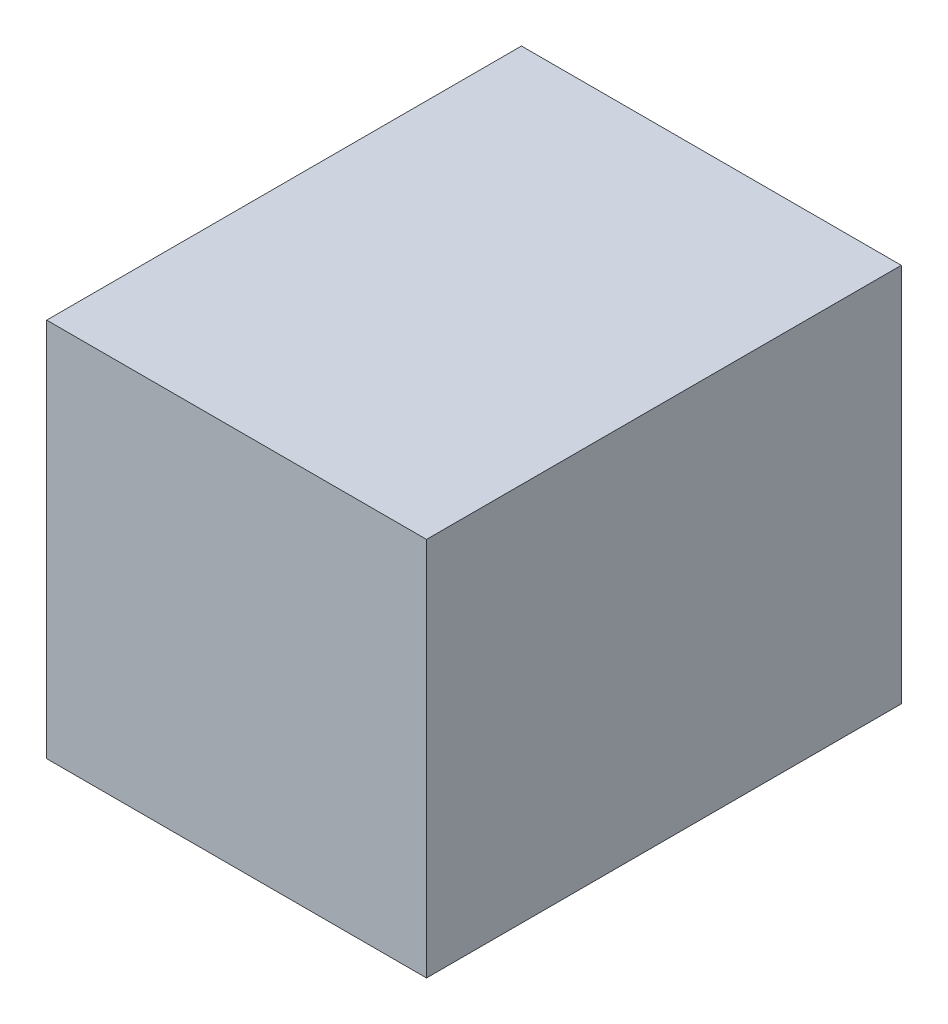
ISO-10303-21;
HEADER;
FILE_DESCRIPTION(('STEP AP214'),'2;1');
FILE_NAME('part.step','',(''),(''),'','','');
FILE_SCHEMA(('AUTOMOTIVE_DESIGN { 1 0 10303 214 1 1 1 1 }'));
ENDSEC;
DATA;
#1=APPLICATION_CONTEXT('core data for automotive mechanical design processes');
#2=APPLICATION_PROTOCOL_DEFINITION('international standard','automotive_design',2000,#1);
#3=PRODUCT_CONTEXT('',#1,'mechanical');
#4=PRODUCT('Part','Part','',(#3));
#5=PRODUCT_RELATED_PRODUCT_CATEGORY('part','',(#4));
#6=PRODUCT_DEFINITION_FORMATION('','',#4);
#7=PRODUCT_DEFINITION_CONTEXT('part definition',#1,'design');
#8=PRODUCT_DEFINITION('design','',#6,#7);
#9=PRODUCT_DEFINITION_SHAPE('','',#8);
#10=(LENGTH_UNIT() NAMED_UNIT(*) SI_UNIT(.MILLI.,.METRE.));
#11=(NAMED_UNIT(*) PLANE_ANGLE_UNIT() SI_UNIT($,.RADIAN.));
#12=(NAMED_UNIT(*) SI_UNIT($,.STERADIAN.) SOLID_ANGLE_UNIT());
#13=UNCERTAINTY_MEASURE_WITH_UNIT(LENGTH_MEASURE(1.E-05),#10,'distance_accuracy_value','');
#14=(GEOMETRIC_REPRESENTATION_CONTEXT(3) GLOBAL_UNCERTAINTY_ASSIGNED_CONTEXT((#13)) GLOBAL_UNIT_ASSIGNED_CONTEXT((#10,
#11,#12)) REPRESENTATION_CONTEXT('',''));
#15=CARTESIAN_POINT('',(0.,0.,0.));
#16=DIRECTION('',(0.,0.,1.));
#17=DIRECTION('',(1.,0.,0.));
#18=AXIS2_PLACEMENT_3D('',#15,#16,#17);
#19=CARTESIAN_POINT('',(1.27741935483871,-1.26451612903226,3.));
#20=DIRECTION('',(-1.,0.,0.));
#21=DIRECTION('',(0.,0.,1.));
#22=AXIS2_PLACEMENT_3D('',#19,#20,#21);
#23=PLANE('',#22);
#24=DIRECTION('',(0.,1.,0.));
#25=VECTOR('',#24,1.);
#26=CARTESIAN_POINT('',(1.27741935483871,-1.26451612903226,0.));
#27=LINE('',#26,#25);
#28=CARTESIAN_POINT('',(1.27741935483871,-1.26451612903226,0.));
#29=VERTEX_POINT('',#28);
#30=CARTESIAN_POINT('',(1.27741935483871,1.13548387096774,0.));
#31=VERTEX_POINT('',#30);
#32=EDGE_CURVE('E97',#29,#31,#27,.T.);
#33=ORIENTED_EDGE('',*,*,#32,.T.);
#34=DIRECTION('',(0.,0.,-1.));
#35=VECTOR('',#34,1.);
#36=CARTESIAN_POINT('',(1.27741935483871,1.13548387096774,3.));
#37=LINE('',#36,#35);
#38=CARTESIAN_POINT('',(1.27741935483871,1.13548387096774,3.));
#39=VERTEX_POINT('',#38);
#40=EDGE_CURVE('E11',#39,#31,#37,.T.);
#41=ORIENTED_EDGE('',*,*,#40,.F.);
#42=DIRECTION('',(0.,1.,0.));
#43=VECTOR('',#42,1.);
#44=CARTESIAN_POINT('',(1.27741935483871,-1.26451612903226,3.));
#45=LINE('',#44,#43);
#46=CARTESIAN_POINT('',(1.27741935483871,-1.26451612903226,3.));
#47=VERTEX_POINT('',#46);
#48=EDGE_CURVE('E85',#47,#39,#45,.T.);
#49=ORIENTED_EDGE('',*,*,#48,.F.);
#50=DIRECTION('',(0.,0.,-1.));
#51=VECTOR('',#50,1.);
#52=CARTESIAN_POINT('',(1.27741935483871,-1.26451612903226,3.));
#53=LINE('',#52,#51);
#54=EDGE_CURVE('E93',#47,#29,#53,.T.);
#55=ORIENTED_EDGE('',*,*,#54,.T.);
#56=EDGE_LOOP('',(#33,#41,#49,#55));
#57=FACE_BOUND('',#56,.T.);
#58=ADVANCED_FACE('F34',(#57),#23,.F.);
#59=CARTESIAN_POINT('',(1.27741935483871,1.13548387096774,3.));
#60=DIRECTION('',(0.,-1.,0.));
#61=DIRECTION('',(0.,0.,-1.));
#62=AXIS2_PLACEMENT_3D('',#59,#60,#61);
#63=PLANE('',#62);
#64=DIRECTION('',(-1.,0.,0.));
#65=VECTOR('',#64,1.);
#66=CARTESIAN_POINT('',(1.27741935483871,1.13548387096774,0.));
#67=LINE('',#66,#65);
#68=CARTESIAN_POINT('',(-1.12258064516129,1.13548387096774,0.));
#69=VERTEX_POINT('',#68);
#70=EDGE_CURVE('E89',#31,#69,#67,.T.);
#71=ORIENTED_EDGE('',*,*,#70,.T.);
#72=DIRECTION('',(0.,0.,-1.));
#73=VECTOR('',#72,1.);
#74=CARTESIAN_POINT('',(-1.12258064516129,1.13548387096774,3.));
#75=LINE('',#74,#73);
#76=CARTESIAN_POINT('',(-1.12258064516129,1.13548387096774,3.));
#77=VERTEX_POINT('',#76);
#78=EDGE_CURVE('E42',#77,#69,#75,.T.);
#79=ORIENTED_EDGE('',*,*,#78,.F.);
#80=DIRECTION('',(-1.,0.,0.));
#81=VECTOR('',#80,1.);
#82=CARTESIAN_POINT('',(1.27741935483871,1.13548387096774,3.));
#83=LINE('',#82,#81);
#84=EDGE_CURVE('E80',#39,#77,#83,.T.);
#85=ORIENTED_EDGE('',*,*,#84,.F.);
#86=ORIENTED_EDGE('',*,*,#40,.T.);
#87=EDGE_LOOP('',(#71,#79,#85,#86));
#88=FACE_BOUND('',#87,.T.);
#89=ADVANCED_FACE('F88',(#88),#63,.F.);
#90=CARTESIAN_POINT('',(-1.12258064516129,-1.26451612903226,3.));
#91=DIRECTION('',(1.,0.,0.));
#92=DIRECTION('',(0.,1.,0.));
#93=AXIS2_PLACEMENT_3D('',#90,#91,#92);
#94=PLANE('',#93);
#95=DIRECTION('',(0.,-1.,0.));
#96=VECTOR('',#95,1.);
#97=CARTESIAN_POINT('',(-1.12258064516129,-1.26451612903226,0.));
#98=LINE('',#97,#96);
#99=CARTESIAN_POINT('',(-1.12258064516129,-1.26451612903226,0.));
#100=VERTEX_POINT('',#99);
#101=EDGE_CURVE('E67',#69,#100,#98,.T.);
#102=ORIENTED_EDGE('',*,*,#101,.T.);
#103=DIRECTION('',(0.,0.,-1.));
#104=VECTOR('',#103,1.);
#105=CARTESIAN_POINT('',(-1.12258064516129,-1.26451612903226,3.));
#106=LINE('',#105,#104);
#107=CARTESIAN_POINT('',(-1.12258064516129,-1.26451612903226,3.));
#108=VERTEX_POINT('',#107);
#109=EDGE_CURVE('E90',#108,#100,#106,.T.);
#110=ORIENTED_EDGE('',*,*,#109,.F.);
#111=DIRECTION('',(0.,-1.,0.));
#112=VECTOR('',#111,1.);
#113=CARTESIAN_POINT('',(-1.12258064516129,-1.26451612903226,3.));
#114=LINE('',#113,#112);
#115=EDGE_CURVE('E83',#77,#108,#114,.T.);
#116=ORIENTED_EDGE('',*,*,#115,.F.);
#117=ORIENTED_EDGE('',*,*,#78,.T.);
#118=EDGE_LOOP('',(#102,#110,#116,#117));
#119=FACE_BOUND('',#118,.T.);
#120=ADVANCED_FACE('F91',(#119),#94,.F.);
#121=CARTESIAN_POINT('',(1.27741935483871,-1.26451612903226,3.));
#122=DIRECTION('',(0.,1.,0.));
#123=DIRECTION('',(-1.,0.,0.));
#124=AXIS2_PLACEMENT_3D('',#121,#122,#123);
#125=PLANE('',#124);
#126=DIRECTION('',(1.,0.,0.));
#127=VECTOR('',#126,1.);
#128=CARTESIAN_POINT('',(1.27741935483871,-1.26451612903226,0.));
#129=LINE('',#128,#127);
#130=EDGE_CURVE('E73',#100,#29,#129,.T.);
#131=ORIENTED_EDGE('',*,*,#130,.T.);
#132=ORIENTED_EDGE('',*,*,#54,.F.);
#133=DIRECTION('',(1.,0.,0.));
#134=VECTOR('',#133,1.);
#135=CARTESIAN_POINT('',(1.27741935483871,-1.26451612903226,3.));
#136=LINE('',#135,#134);
#137=EDGE_CURVE('E50',#108,#47,#136,.T.);
#138=ORIENTED_EDGE('',*,*,#137,.F.);
#139=ORIENTED_EDGE('',*,*,#109,.T.);
#140=EDGE_LOOP('',(#131,#132,#138,#139));
#141=FACE_BOUND('',#140,.T.);
#142=ADVANCED_FACE('F104',(#141),#125,.F.);
#143=CARTESIAN_POINT('',(0.,0.,3.));
#144=DIRECTION('',(0.,0.,1.));
#145=DIRECTION('',(1.,0.,0.));
#146=AXIS2_PLACEMENT_3D('',#143,#144,#145);
#147=PLANE('',#146);
#148=ORIENTED_EDGE('',*,*,#48,.T.);
#149=ORIENTED_EDGE('',*,*,#84,.T.);
#150=ORIENTED_EDGE('',*,*,#115,.T.);
#151=ORIENTED_EDGE('',*,*,#137,.T.);
#152=EDGE_LOOP('',(#148,#149,#150,#151));
#153=FACE_BOUND('',#152,.T.);
#154=ADVANCED_FACE('F81',(#153),#147,.T.);
#155=CARTESIAN_POINT('',(0.,0.,0.));
#156=DIRECTION('',(0.,0.,1.));
#157=DIRECTION('',(1.,0.,0.));
#158=AXIS2_PLACEMENT_3D('',#155,#156,#157);
#159=PLANE('',#158);
#160=ORIENTED_EDGE('',*,*,#32,.F.);
#161=ORIENTED_EDGE('',*,*,#130,.F.);
#162=ORIENTED_EDGE('',*,*,#101,.F.);
#163=ORIENTED_EDGE('',*,*,#70,.F.);
#164=EDGE_LOOP('',(#160,#161,#162,#163));
#165=FACE_BOUND('',#164,.T.);
#166=ADVANCED_FACE('F107',(#165),#159,.F.);
#167=CLOSED_SHELL('',(#58,#89,#120,#142,#154,#166));
#168=MANIFOLD_SOLID_BREP('B2',#167);
#169=ADVANCED_BREP_SHAPE_REPRESENTATION('',(#18,#168),#14);
#170=SHAPE_DEFINITION_REPRESENTATION(#9,#169);
ENDSEC;
END-ISO-10303-21;
